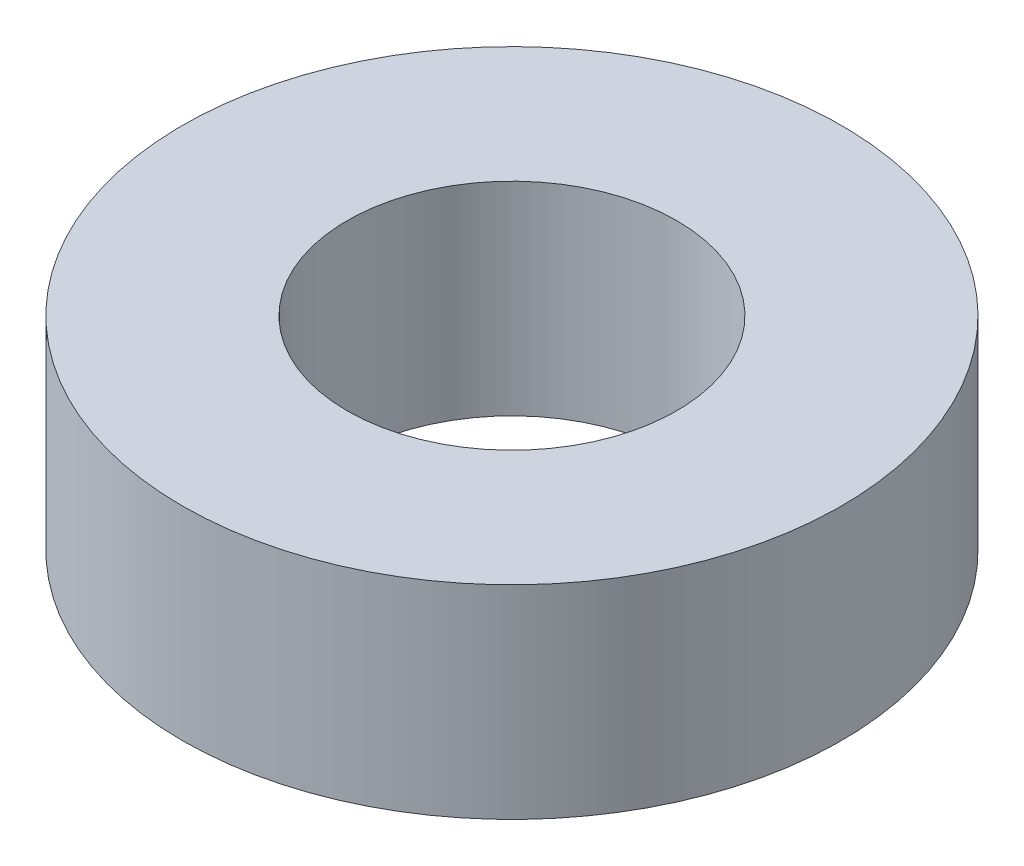
ISO-10303-21;
HEADER;
FILE_DESCRIPTION(('STEP AP214'),'2;1');
FILE_NAME('part.step','',(''),(''),'','','');
FILE_SCHEMA(('AUTOMOTIVE_DESIGN { 1 0 10303 214 1 1 1 1 }'));
ENDSEC;
DATA;
#1=APPLICATION_CONTEXT('core data for automotive mechanical design processes');
#2=APPLICATION_PROTOCOL_DEFINITION('international standard','automotive_design',2000,#1);
#3=PRODUCT_CONTEXT('',#1,'mechanical');
#4=PRODUCT('Part','Part','',(#3));
#5=PRODUCT_RELATED_PRODUCT_CATEGORY('part','',(#4));
#6=PRODUCT_DEFINITION_FORMATION('','',#4);
#7=PRODUCT_DEFINITION_CONTEXT('part definition',#1,'design');
#8=PRODUCT_DEFINITION('design','',#6,#7);
#9=PRODUCT_DEFINITION_SHAPE('','',#8);
#10=(LENGTH_UNIT() NAMED_UNIT(*) SI_UNIT(.MILLI.,.METRE.));
#11=(NAMED_UNIT(*) PLANE_ANGLE_UNIT() SI_UNIT($,.RADIAN.));
#12=(NAMED_UNIT(*) SI_UNIT($,.STERADIAN.) SOLID_ANGLE_UNIT());
#13=UNCERTAINTY_MEASURE_WITH_UNIT(LENGTH_MEASURE(1.E-05),#10,'distance_accuracy_value','');
#14=(GEOMETRIC_REPRESENTATION_CONTEXT(3) GLOBAL_UNCERTAINTY_ASSIGNED_CONTEXT((#13)) GLOBAL_UNIT_ASSIGNED_CONTEXT((#10,
#11,#12)) REPRESENTATION_CONTEXT('',''));
#15=CARTESIAN_POINT('',(0.,0.,0.));
#16=DIRECTION('',(0.,0.,1.));
#17=DIRECTION('',(1.,0.,0.));
#18=AXIS2_PLACEMENT_3D('',#15,#16,#17);
#19=CARTESIAN_POINT('',(0.,1.85,0.));
#20=DIRECTION('',(0.,1.,0.));
#21=DIRECTION('',(0.,0.,1.));
#22=AXIS2_PLACEMENT_3D('',#19,#20,#21);
#23=PLANE('',#22);
#24=CARTESIAN_POINT('',(0.,1.85,0.));
#25=DIRECTION('',(0.,1.,0.));
#26=DIRECTION('',(0.,0.,1.));
#27=AXIS2_PLACEMENT_3D('',#24,#25,#26);
#28=CIRCLE('',#27,3.);
#29=CARTESIAN_POINT('',(0.,1.85,3.));
#30=VERTEX_POINT('',#29);
#31=EDGE_CURVE('E10',#30,#30,#28,.T.);
#32=ORIENTED_EDGE('',*,*,#31,.T.);
#33=EDGE_LOOP('',(#32));
#34=FACE_BOUND('',#33,.T.);
#35=CARTESIAN_POINT('',(0.,1.85,0.));
#36=DIRECTION('',(0.,1.,0.));
#37=DIRECTION('',(0.,0.,1.));
#38=AXIS2_PLACEMENT_3D('',#35,#36,#37);
#39=CIRCLE('',#38,1.5);
#40=CARTESIAN_POINT('',(0.,1.85,1.5));
#41=VERTEX_POINT('',#40);
#42=EDGE_CURVE('E50',#41,#41,#39,.T.);
#43=ORIENTED_EDGE('',*,*,#42,.F.);
#44=EDGE_LOOP('',(#43));
#45=FACE_BOUND('',#44,.T.);
#46=ADVANCED_FACE('F37',(#34,#45),#23,.T.);
#47=CARTESIAN_POINT('',(0.,0.,0.));
#48=DIRECTION('',(0.,1.,0.));
#49=DIRECTION('',(0.,0.,1.));
#50=AXIS2_PLACEMENT_3D('',#47,#48,#49);
#51=PLANE('',#50);
#52=CARTESIAN_POINT('',(0.,0.,0.));
#53=DIRECTION('',(0.,1.,0.));
#54=DIRECTION('',(0.,0.,1.));
#55=AXIS2_PLACEMENT_3D('',#52,#53,#54);
#56=CIRCLE('',#55,3.);
#57=CARTESIAN_POINT('',(0.,0.,3.));
#58=VERTEX_POINT('',#57);
#59=EDGE_CURVE('E41',#58,#58,#56,.T.);
#60=ORIENTED_EDGE('',*,*,#59,.F.);
#61=EDGE_LOOP('',(#60));
#62=FACE_BOUND('',#61,.T.);
#63=CARTESIAN_POINT('',(0.,0.,0.));
#64=DIRECTION('',(0.,1.,0.));
#65=DIRECTION('',(0.,0.,1.));
#66=AXIS2_PLACEMENT_3D('',#63,#64,#65);
#67=CIRCLE('',#66,1.5);
#68=CARTESIAN_POINT('',(0.,0.,1.5));
#69=VERTEX_POINT('',#68);
#70=EDGE_CURVE('E52',#69,#69,#67,.T.);
#71=ORIENTED_EDGE('',*,*,#70,.T.);
#72=EDGE_LOOP('',(#71));
#73=FACE_BOUND('',#72,.T.);
#74=ADVANCED_FACE('F64',(#62,#73),#51,.F.);
#75=CARTESIAN_POINT('',(0.,1.85,0.));
#76=DIRECTION('',(0.,-1.,0.));
#77=DIRECTION('',(0.,0.,-1.));
#78=AXIS2_PLACEMENT_3D('',#75,#76,#77);
#79=CYLINDRICAL_SURFACE('',#78,3.);
#80=ORIENTED_EDGE('',*,*,#31,.F.);
#81=EDGE_LOOP('',(#80));
#82=FACE_BOUND('',#81,.T.);
#83=ORIENTED_EDGE('',*,*,#59,.T.);
#84=EDGE_LOOP('',(#83));
#85=FACE_BOUND('',#84,.T.);
#86=ADVANCED_FACE('F39',(#82,#85),#79,.T.);
#87=CARTESIAN_POINT('',(0.,1.85,0.));
#88=DIRECTION('',(0.,-1.,0.));
#89=DIRECTION('',(0.,0.,-1.));
#90=AXIS2_PLACEMENT_3D('',#87,#88,#89);
#91=CYLINDRICAL_SURFACE('',#90,1.5);
#92=ORIENTED_EDGE('',*,*,#42,.T.);
#93=EDGE_LOOP('',(#92));
#94=FACE_BOUND('',#93,.T.);
#95=ORIENTED_EDGE('',*,*,#70,.F.);
#96=EDGE_LOOP('',(#95));
#97=FACE_BOUND('',#96,.T.);
#98=ADVANCED_FACE('F60',(#94,#97),#91,.F.);
#99=CLOSED_SHELL('',(#46,#74,#86,#98));
#100=MANIFOLD_SOLID_BREP('B2',#99);
#101=ADVANCED_BREP_SHAPE_REPRESENTATION('',(#18,#100),#14);
#102=SHAPE_DEFINITION_REPRESENTATION(#9,#101);
ENDSEC;
END-ISO-10303-21;
